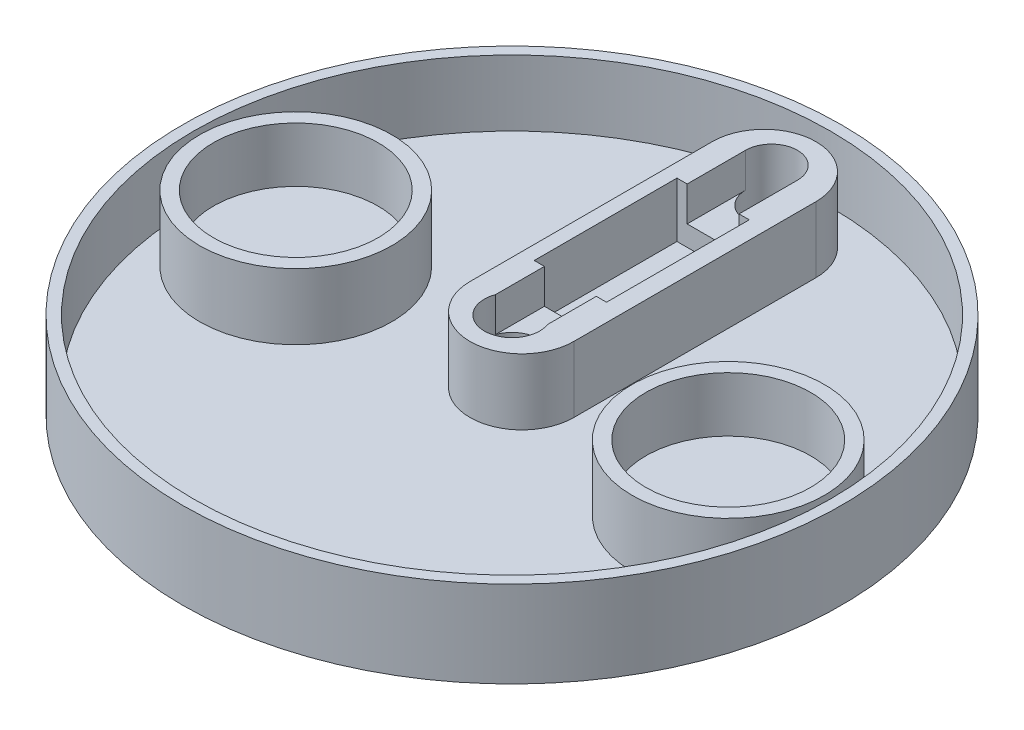
ISO-10303-21;
HEADER;
FILE_DESCRIPTION(('STEP AP214'),'2;1');
FILE_NAME('part.step','',(''),(''),'','','');
FILE_SCHEMA(('AUTOMOTIVE_DESIGN { 1 0 10303 214 1 1 1 1 }'));
ENDSEC;
DATA;
#1=APPLICATION_CONTEXT('core data for automotive mechanical design processes');
#2=APPLICATION_PROTOCOL_DEFINITION('international standard','automotive_design',2000,#1);
#3=PRODUCT_CONTEXT('',#1,'mechanical');
#4=PRODUCT('Part','Part','',(#3));
#5=PRODUCT_RELATED_PRODUCT_CATEGORY('part','',(#4));
#6=PRODUCT_DEFINITION_FORMATION('','',#4);
#7=PRODUCT_DEFINITION_CONTEXT('part definition',#1,'design');
#8=PRODUCT_DEFINITION('design','',#6,#7);
#9=PRODUCT_DEFINITION_SHAPE('','',#8);
#10=(LENGTH_UNIT() NAMED_UNIT(*) SI_UNIT(.MILLI.,.METRE.));
#11=(NAMED_UNIT(*) PLANE_ANGLE_UNIT() SI_UNIT($,.RADIAN.));
#12=(NAMED_UNIT(*) SI_UNIT($,.STERADIAN.) SOLID_ANGLE_UNIT());
#13=UNCERTAINTY_MEASURE_WITH_UNIT(LENGTH_MEASURE(1.E-05),#10,'distance_accuracy_value','');
#14=(GEOMETRIC_REPRESENTATION_CONTEXT(3) GLOBAL_UNCERTAINTY_ASSIGNED_CONTEXT((#13)) GLOBAL_UNIT_ASSIGNED_CONTEXT((#10,
#11,#12)) REPRESENTATION_CONTEXT('',''));
#15=CARTESIAN_POINT('',(0.,0.,0.));
#16=DIRECTION('',(0.,0.,1.));
#17=DIRECTION('',(1.,0.,0.));
#18=AXIS2_PLACEMENT_3D('',#15,#16,#17);
#19=CARTESIAN_POINT('',(0.213535998229149,10.,-28.9330974921723));
#20=DIRECTION('',(0.,1.,0.));
#21=DIRECTION('',(0.,0.,1.));
#22=AXIS2_PLACEMENT_3D('',#19,#20,#21);
#23=CYLINDRICAL_SURFACE('',#22,6.);
#24=DIRECTION('',(0.,1.,0.));
#25=VECTOR('',#24,1.);
#26=CARTESIAN_POINT('',(-5.78646400177085,2.38,-28.9330974921723));
#27=LINE('',#26,#25);
#28=CARTESIAN_POINT('',(-5.78646400177085,10.,-28.9330974921723));
#29=VERTEX_POINT('',#28);
#30=CARTESIAN_POINT('',(-5.78646400177085,2.38,-28.9330974921723));
#31=VERTEX_POINT('',#30);
#32=EDGE_CURVE('E328',#29,#31,#27,.F.);
#33=ORIENTED_EDGE('',*,*,#32,.F.);
#34=CARTESIAN_POINT('',(0.213535998229149,10.,-28.9330974921723));
#35=DIRECTION('',(0.,1.,0.));
#36=DIRECTION('',(0.,0.,1.));
#37=AXIS2_PLACEMENT_3D('',#34,#35,#36);
#38=CIRCLE('',#37,6.);
#39=CARTESIAN_POINT('',(6.21353599822915,10.,-28.9330974921723));
#40=VERTEX_POINT('',#39);
#41=EDGE_CURVE('E49',#40,#29,#38,.T.);
#42=ORIENTED_EDGE('',*,*,#41,.F.);
#43=DIRECTION('',(0.,1.,0.));
#44=VECTOR('',#43,1.);
#45=CARTESIAN_POINT('',(6.21353599822915,2.38,-28.9330974921723));
#46=LINE('',#45,#44);
#47=CARTESIAN_POINT('',(6.21353599822915,2.38,-28.9330974921723));
#48=VERTEX_POINT('',#47);
#49=EDGE_CURVE('E332',#48,#40,#46,.T.);
#50=ORIENTED_EDGE('',*,*,#49,.F.);
#51=CARTESIAN_POINT('',(0.213535998229149,2.38,-28.9330974921723));
#52=DIRECTION('',(0.,1.,0.));
#53=DIRECTION('',(0.,0.,1.));
#54=AXIS2_PLACEMENT_3D('',#51,#52,#53);
#55=CIRCLE('',#54,6.);
#56=EDGE_CURVE('E11',#48,#31,#55,.T.);
#57=ORIENTED_EDGE('',*,*,#56,.T.);
#58=EDGE_LOOP('',(#33,#42,#50,#57));
#59=FACE_BOUND('',#58,.T.);
#60=ADVANCED_FACE('F40',(#59),#23,.T.);
#61=CARTESIAN_POINT('',(0.213535998229152,2.38,-0.933097492172249));
#62=DIRECTION('',(0.,1.,0.));
#63=DIRECTION('',(0.,0.,1.));
#64=AXIS2_PLACEMENT_3D('',#61,#62,#63);
#65=CYLINDRICAL_SURFACE('',#64,6.);
#66=DIRECTION('',(0.,1.,0.));
#67=VECTOR('',#66,1.);
#68=CARTESIAN_POINT('',(-5.78646400177085,2.38,-0.933097492172248));
#69=LINE('',#68,#67);
#70=CARTESIAN_POINT('',(-5.78646400177085,2.38,-0.933097492172248));
#71=VERTEX_POINT('',#70);
#72=CARTESIAN_POINT('',(-5.78646400177085,10.,-0.933097492172248));
#73=VERTEX_POINT('',#72);
#74=EDGE_CURVE('E314',#71,#73,#69,.T.);
#75=ORIENTED_EDGE('',*,*,#74,.F.);
#76=CARTESIAN_POINT('',(0.213535998229152,2.38,-0.933097492172249));
#77=DIRECTION('',(0.,1.,0.));
#78=DIRECTION('',(0.,0.,1.));
#79=AXIS2_PLACEMENT_3D('',#76,#77,#78);
#80=CIRCLE('',#79,6.);
#81=CARTESIAN_POINT('',(6.21353599822915,2.38,-0.933097492172248));
#82=VERTEX_POINT('',#81);
#83=EDGE_CURVE('E325',#71,#82,#80,.T.);
#84=ORIENTED_EDGE('',*,*,#83,.T.);
#85=DIRECTION('',(0.,1.,0.));
#86=VECTOR('',#85,1.);
#87=CARTESIAN_POINT('',(6.21353599822915,2.38,-0.933097492172248));
#88=LINE('',#87,#86);
#89=CARTESIAN_POINT('',(6.21353599822915,10.,-0.933097492172248));
#90=VERTEX_POINT('',#89);
#91=EDGE_CURVE('E318',#90,#82,#88,.F.);
#92=ORIENTED_EDGE('',*,*,#91,.F.);
#93=CARTESIAN_POINT('',(0.213535998229152,10.,-0.933097492172249));
#94=DIRECTION('',(0.,1.,0.));
#95=DIRECTION('',(0.,0.,1.));
#96=AXIS2_PLACEMENT_3D('',#93,#94,#95);
#97=CIRCLE('',#96,6.);
#98=EDGE_CURVE('E322',#73,#90,#97,.T.);
#99=ORIENTED_EDGE('',*,*,#98,.F.);
#100=EDGE_LOOP('',(#75,#84,#92,#99));
#101=FACE_BOUND('',#100,.T.);
#102=ADVANCED_FACE('F446',(#101),#65,.T.);
#103=CARTESIAN_POINT('',(0.,10.,0.));
#104=DIRECTION('',(0.,1.,0.));
#105=DIRECTION('',(0.,0.,1.));
#106=AXIS2_PLACEMENT_3D('',#103,#104,#105);
#107=PLANE('',#106);
#108=DIRECTION('',(0.,0.,-1.));
#109=VECTOR('',#108,1.);
#110=CARTESIAN_POINT('',(3.,10.,-30.));
#111=LINE('',#110,#109);
#112=CARTESIAN_POINT('',(3.,10.,-1.113552872566));
#113=VERTEX_POINT('',#112);
#114=CARTESIAN_POINT('',(3.,10.,-6.74893096043785));
#115=VERTEX_POINT('',#114);
#116=EDGE_CURVE('E387',#113,#115,#111,.T.);
#117=ORIENTED_EDGE('',*,*,#116,.F.);
#118=CARTESIAN_POINT('',(0.,10.,0.));
#119=DIRECTION('',(0.,1.,0.));
#120=DIRECTION('',(0.,0.,1.));
#121=AXIS2_PLACEMENT_3D('',#118,#119,#120);
#122=CIRCLE('',#121,3.2);
#123=CARTESIAN_POINT('',(-3.,10.,-1.11355287256601));
#124=VERTEX_POINT('',#123);
#125=EDGE_CURVE('E209',#124,#113,#122,.T.);
#126=ORIENTED_EDGE('',*,*,#125,.F.);
#127=DIRECTION('',(0.,0.,1.));
#128=VECTOR('',#127,1.);
#129=CARTESIAN_POINT('',(-3.,10.,-30.));
#130=LINE('',#129,#128);
#131=CARTESIAN_POINT('',(-3.,10.,-6.74893096043785));
#132=VERTEX_POINT('',#131);
#133=EDGE_CURVE('E378',#132,#124,#130,.T.);
#134=ORIENTED_EDGE('',*,*,#133,.F.);
#135=DIRECTION('',(1.,0.,0.));
#136=VECTOR('',#135,1.);
#137=CARTESIAN_POINT('',(-4.17911289016784,10.,-6.74893096043785));
#138=LINE('',#137,#136);
#139=CARTESIAN_POINT('',(-4.17911289016784,10.,-6.74893096043785));
#140=VERTEX_POINT('',#139);
#141=EDGE_CURVE('E245',#140,#132,#138,.T.);
#142=ORIENTED_EDGE('',*,*,#141,.F.);
#143=DIRECTION('',(0.,0.,1.));
#144=VECTOR('',#143,1.);
#145=CARTESIAN_POINT('',(-4.17911289016784,10.,-23.2510690395621));
#146=LINE('',#145,#144);
#147=CARTESIAN_POINT('',(-4.17911289016784,10.,-23.2510690395621));
#148=VERTEX_POINT('',#147);
#149=EDGE_CURVE('E265',#148,#140,#146,.T.);
#150=ORIENTED_EDGE('',*,*,#149,.F.);
#151=DIRECTION('',(-1.,0.,0.));
#152=VECTOR('',#151,1.);
#153=CARTESIAN_POINT('',(-4.17911289016784,10.,-23.2510690395621));
#154=LINE('',#153,#152);
#155=CARTESIAN_POINT('',(-3.,10.,-23.2510690395621));
#156=VERTEX_POINT('',#155);
#157=EDGE_CURVE('E260',#156,#148,#154,.T.);
#158=ORIENTED_EDGE('',*,*,#157,.F.);
#159=CARTESIAN_POINT('',(-3.,10.,-30.));
#160=VERTEX_POINT('',#159);
#161=EDGE_CURVE('E383',#160,#156,#130,.T.);
#162=ORIENTED_EDGE('',*,*,#161,.F.);
#163=CARTESIAN_POINT('',(0.,10.,-30.));
#164=DIRECTION('',(0.,1.,0.));
#165=DIRECTION('',(0.,0.,1.));
#166=AXIS2_PLACEMENT_3D('',#163,#164,#165);
#167=CIRCLE('',#166,3.);
#168=CARTESIAN_POINT('',(3.,10.,-30.));
#169=VERTEX_POINT('',#168);
#170=EDGE_CURVE('E178',#169,#160,#167,.T.);
#171=ORIENTED_EDGE('',*,*,#170,.F.);
#172=CARTESIAN_POINT('',(3.,10.,-23.2510690395621));
#173=VERTEX_POINT('',#172);
#174=EDGE_CURVE('E385',#173,#169,#111,.T.);
#175=ORIENTED_EDGE('',*,*,#174,.F.);
#176=CARTESIAN_POINT('',(4.17911289016784,10.,-23.2510690395621));
#177=VERTEX_POINT('',#176);
#178=EDGE_CURVE('E261',#177,#173,#154,.T.);
#179=ORIENTED_EDGE('',*,*,#178,.F.);
#180=DIRECTION('',(0.,0.,-1.));
#181=VECTOR('',#180,1.);
#182=CARTESIAN_POINT('',(4.17911289016784,10.,-23.2510690395621));
#183=LINE('',#182,#181);
#184=CARTESIAN_POINT('',(4.17911289016784,10.,-6.74893096043785));
#185=VERTEX_POINT('',#184);
#186=EDGE_CURVE('E222',#185,#177,#183,.T.);
#187=ORIENTED_EDGE('',*,*,#186,.F.);
#188=EDGE_CURVE('E269',#115,#185,#138,.T.);
#189=ORIENTED_EDGE('',*,*,#188,.F.);
#190=EDGE_LOOP('',(#117,#126,#134,#142,#150,#158,#162,#171,#175,#179,#187,#189));
#191=FACE_BOUND('',#190,.T.);
#192=DIRECTION('',(0.,0.,-1.));
#193=VECTOR('',#192,1.);
#194=CARTESIAN_POINT('',(6.21353599822915,10.,-34.9330974921723));
#195=LINE('',#194,#193);
#196=EDGE_CURVE('E342',#90,#40,#195,.T.);
#197=ORIENTED_EDGE('',*,*,#196,.T.);
#198=ORIENTED_EDGE('',*,*,#41,.T.);
#199=DIRECTION('',(0.,0.,1.));
#200=VECTOR('',#199,1.);
#201=CARTESIAN_POINT('',(-5.78646400177085,10.,-34.9330974921723));
#202=LINE('',#201,#200);
#203=EDGE_CURVE('E339',#29,#73,#202,.T.);
#204=ORIENTED_EDGE('',*,*,#203,.T.);
#205=ORIENTED_EDGE('',*,*,#98,.T.);
#206=EDGE_LOOP('',(#197,#198,#204,#205));
#207=FACE_BOUND('',#206,.T.);
#208=ADVANCED_FACE('F337',(#191,#207),#107,.T.);
#209=CARTESIAN_POINT('',(0.,0.,-30.));
#210=DIRECTION('',(0.,1.,0.));
#211=DIRECTION('',(0.,0.,1.));
#212=AXIS2_PLACEMENT_3D('',#209,#210,#211);
#213=CYLINDRICAL_SURFACE('',#212,3.);
#214=CARTESIAN_POINT('',(0.,0.,-30.));
#215=DIRECTION('',(0.,1.,0.));
#216=DIRECTION('',(0.,0.,1.));
#217=AXIS2_PLACEMENT_3D('',#214,#215,#216);
#218=CIRCLE('',#217,3.);
#219=CARTESIAN_POINT('',(0.,0.,-27.));
#220=VERTEX_POINT('',#219);
#221=EDGE_CURVE('E286',#220,#220,#218,.T.);
#222=ORIENTED_EDGE('',*,*,#221,.F.);
#223=EDGE_LOOP('',(#222));
#224=FACE_BOUND('',#223,.T.);
#225=CARTESIAN_POINT('',(0.,6.,-30.));
#226=DIRECTION('',(0.,1.,0.));
#227=DIRECTION('',(0.,0.,1.));
#228=AXIS2_PLACEMENT_3D('',#225,#226,#227);
#229=CIRCLE('',#228,3.);
#230=CARTESIAN_POINT('',(3.,6.,-30.));
#231=VERTEX_POINT('',#230);
#232=CARTESIAN_POINT('',(-3.,6.,-30.));
#233=VERTEX_POINT('',#232);
#234=EDGE_CURVE('E151',#231,#233,#229,.F.);
#235=ORIENTED_EDGE('',*,*,#234,.F.);
#236=DIRECTION('',(0.,1.,0.));
#237=VECTOR('',#236,1.);
#238=CARTESIAN_POINT('',(3.,6.,-30.));
#239=LINE('',#238,#237);
#240=EDGE_CURVE('E180',#231,#169,#239,.T.);
#241=ORIENTED_EDGE('',*,*,#240,.T.);
#242=ORIENTED_EDGE('',*,*,#170,.T.);
#243=DIRECTION('',(0.,1.,0.));
#244=VECTOR('',#243,1.);
#245=CARTESIAN_POINT('',(-3.,6.,-30.));
#246=LINE('',#245,#244);
#247=EDGE_CURVE('E168',#233,#160,#246,.T.);
#248=ORIENTED_EDGE('',*,*,#247,.F.);
#249=EDGE_LOOP('',(#235,#241,#242,#248));
#250=FACE_BOUND('',#249,.T.);
#251=ADVANCED_FACE('F176',(#224,#250),#213,.F.);
#252=CARTESIAN_POINT('',(0.,0.,0.));
#253=DIRECTION('',(0.,1.,0.));
#254=DIRECTION('',(0.,0.,1.));
#255=AXIS2_PLACEMENT_3D('',#252,#253,#254);
#256=CYLINDRICAL_SURFACE('',#255,2.7);
#257=CARTESIAN_POINT('',(0.,0.,0.));
#258=DIRECTION('',(0.,1.,0.));
#259=DIRECTION('',(0.,0.,1.));
#260=AXIS2_PLACEMENT_3D('',#257,#258,#259);
#261=CIRCLE('',#260,2.7);
#262=CARTESIAN_POINT('',(0.,0.,2.7));
#263=VERTEX_POINT('',#262);
#264=EDGE_CURVE('E218',#263,#263,#261,.T.);
#265=ORIENTED_EDGE('',*,*,#264,.F.);
#266=EDGE_LOOP('',(#265));
#267=FACE_BOUND('',#266,.T.);
#268=CARTESIAN_POINT('',(0.,4.,0.));
#269=DIRECTION('',(0.,1.,0.));
#270=DIRECTION('',(0.,0.,1.));
#271=AXIS2_PLACEMENT_3D('',#268,#269,#270);
#272=CIRCLE('',#271,2.7);
#273=CARTESIAN_POINT('',(0.,4.,2.7));
#274=VERTEX_POINT('',#273);
#275=EDGE_CURVE('E214',#274,#274,#272,.F.);
#276=ORIENTED_EDGE('',*,*,#275,.F.);
#277=EDGE_LOOP('',(#276));
#278=FACE_BOUND('',#277,.T.);
#279=ADVANCED_FACE('F463',(#267,#278),#256,.F.);
#280=CARTESIAN_POINT('',(0.,10.,0.));
#281=DIRECTION('',(0.,-1.,0.));
#282=DIRECTION('',(0.,0.,-1.));
#283=AXIS2_PLACEMENT_3D('',#280,#281,#282);
#284=CYLINDRICAL_SURFACE('',#283,38.1);
#285=CARTESIAN_POINT('',(0.,10.,0.));
#286=DIRECTION('',(0.,1.,0.));
#287=DIRECTION('',(0.,0.,1.));
#288=AXIS2_PLACEMENT_3D('',#285,#286,#287);
#289=CIRCLE('',#288,38.1);
#290=CARTESIAN_POINT('',(0.,10.,38.1));
#291=VERTEX_POINT('',#290);
#292=EDGE_CURVE('E293',#291,#291,#289,.T.);
#293=ORIENTED_EDGE('',*,*,#292,.F.);
#294=EDGE_LOOP('',(#293));
#295=FACE_BOUND('',#294,.T.);
#296=CARTESIAN_POINT('',(0.,0.,0.));
#297=DIRECTION('',(0.,1.,0.));
#298=DIRECTION('',(0.,0.,1.));
#299=AXIS2_PLACEMENT_3D('',#296,#297,#298);
#300=CIRCLE('',#299,38.1);
#301=CARTESIAN_POINT('',(0.,0.,38.1));
#302=VERTEX_POINT('',#301);
#303=EDGE_CURVE('E290',#302,#302,#300,.T.);
#304=ORIENTED_EDGE('',*,*,#303,.T.);
#305=EDGE_LOOP('',(#304));
#306=FACE_BOUND('',#305,.T.);
#307=ADVANCED_FACE('F461',(#295,#306),#284,.T.);
#308=CARTESIAN_POINT('',(0.,10.,0.));
#309=DIRECTION('',(0.,1.,0.));
#310=DIRECTION('',(0.,0.,1.));
#311=AXIS2_PLACEMENT_3D('',#308,#309,#310);
#312=CIRCLE('',#311,36.83);
#313=CARTESIAN_POINT('',(0.,10.,36.83));
#314=VERTEX_POINT('',#313);
#315=EDGE_CURVE('E370',#314,#314,#312,.T.);
#316=ORIENTED_EDGE('',*,*,#315,.F.);
#317=EDGE_LOOP('',(#316));
#318=FACE_BOUND('',#317,.T.);
#319=ORIENTED_EDGE('',*,*,#292,.T.);
#320=EDGE_LOOP('',(#319));
#321=FACE_BOUND('',#320,.T.);
#322=ADVANCED_FACE('F440',(#318,#321),#107,.T.);
#323=CARTESIAN_POINT('',(0.,0.,0.));
#324=DIRECTION('',(0.,1.,0.));
#325=DIRECTION('',(0.,0.,1.));
#326=AXIS2_PLACEMENT_3D('',#323,#324,#325);
#327=PLANE('',#326);
#328=ORIENTED_EDGE('',*,*,#264,.T.);
#329=EDGE_LOOP('',(#328));
#330=FACE_BOUND('',#329,.T.);
#331=ORIENTED_EDGE('',*,*,#221,.T.);
#332=EDGE_LOOP('',(#331));
#333=FACE_BOUND('',#332,.T.);
#334=ORIENTED_EDGE('',*,*,#303,.F.);
#335=EDGE_LOOP('',(#334));
#336=FACE_BOUND('',#335,.T.);
#337=ADVANCED_FACE('F433',(#330,#333,#336),#327,.F.);
#338=CARTESIAN_POINT('',(4.17911289016784,3.65,-23.2510690395621));
#339=DIRECTION('',(1.,0.,0.));
#340=DIRECTION('',(0.,0.,-1.));
#341=AXIS2_PLACEMENT_3D('',#338,#339,#340);
#342=PLANE('',#341);
#343=ORIENTED_EDGE('',*,*,#186,.T.);
#344=DIRECTION('',(0.,1.,0.));
#345=VECTOR('',#344,1.);
#346=CARTESIAN_POINT('',(4.17911289016784,3.65,-23.2510690395621));
#347=LINE('',#346,#345);
#348=CARTESIAN_POINT('',(4.17911289016784,3.65,-23.2510690395621));
#349=VERTEX_POINT('',#348);
#350=EDGE_CURVE('E257',#349,#177,#347,.T.);
#351=ORIENTED_EDGE('',*,*,#350,.F.);
#352=DIRECTION('',(0.,0.,-1.));
#353=VECTOR('',#352,1.);
#354=CARTESIAN_POINT('',(4.17911289016784,3.65,-23.2510690395621));
#355=LINE('',#354,#353);
#356=CARTESIAN_POINT('',(4.17911289016784,3.65,-6.74893096043785));
#357=VERTEX_POINT('',#356);
#358=EDGE_CURVE('E240',#357,#349,#355,.T.);
#359=ORIENTED_EDGE('',*,*,#358,.F.);
#360=DIRECTION('',(0.,1.,0.));
#361=VECTOR('',#360,1.);
#362=CARTESIAN_POINT('',(4.17911289016784,3.65,-6.74893096043785));
#363=LINE('',#362,#361);
#364=EDGE_CURVE('E239',#357,#185,#363,.T.);
#365=ORIENTED_EDGE('',*,*,#364,.T.);
#366=EDGE_LOOP('',(#343,#351,#359,#365));
#367=FACE_BOUND('',#366,.T.);
#368=ADVANCED_FACE('F431',(#367),#342,.F.);
#369=CARTESIAN_POINT('',(-4.17911289016784,3.65,-6.74893096043785));
#370=DIRECTION('',(0.,0.,1.));
#371=DIRECTION('',(1.,0.,0.));
#372=AXIS2_PLACEMENT_3D('',#369,#370,#371);
#373=PLANE('',#372);
#374=DIRECTION('',(-1.,0.,0.));
#375=VECTOR('',#374,1.);
#376=CARTESIAN_POINT('',(-4.17911289016784,6.,-6.74893096043785));
#377=LINE('',#376,#375);
#378=CARTESIAN_POINT('',(3.,6.,-6.74893096043785));
#379=VERTEX_POINT('',#378);
#380=CARTESIAN_POINT('',(-3.,6.,-6.74893096043785));
#381=VERTEX_POINT('',#380);
#382=EDGE_CURVE('E164',#379,#381,#377,.T.);
#383=ORIENTED_EDGE('',*,*,#382,.F.);
#384=DIRECTION('',(0.,1.,0.));
#385=VECTOR('',#384,1.);
#386=CARTESIAN_POINT('',(3.,3.65,-6.74893096043785));
#387=LINE('',#386,#385);
#388=EDGE_CURVE('E205',#379,#115,#387,.T.);
#389=ORIENTED_EDGE('',*,*,#388,.T.);
#390=ORIENTED_EDGE('',*,*,#188,.T.);
#391=ORIENTED_EDGE('',*,*,#364,.F.);
#392=DIRECTION('',(1.,0.,0.));
#393=VECTOR('',#392,1.);
#394=CARTESIAN_POINT('',(-4.17911289016784,3.65,-6.74893096043785));
#395=LINE('',#394,#393);
#396=CARTESIAN_POINT('',(-4.17911289016784,3.65,-6.74893096043785));
#397=VERTEX_POINT('',#396);
#398=EDGE_CURVE('E253',#397,#357,#395,.T.);
#399=ORIENTED_EDGE('',*,*,#398,.F.);
#400=DIRECTION('',(0.,1.,0.));
#401=VECTOR('',#400,1.);
#402=CARTESIAN_POINT('',(-4.17911289016784,3.65,-6.74893096043785));
#403=LINE('',#402,#401);
#404=EDGE_CURVE('E276',#397,#140,#403,.T.);
#405=ORIENTED_EDGE('',*,*,#404,.T.);
#406=ORIENTED_EDGE('',*,*,#141,.T.);
#407=DIRECTION('',(0.,-1.,0.));
#408=VECTOR('',#407,1.);
#409=CARTESIAN_POINT('',(-3.,3.65,-6.74893096043785));
#410=LINE('',#409,#408);
#411=EDGE_CURVE('E197',#132,#381,#410,.T.);
#412=ORIENTED_EDGE('',*,*,#411,.T.);
#413=EDGE_LOOP('',(#383,#389,#390,#391,#399,#405,#406,#412));
#414=FACE_BOUND('',#413,.T.);
#415=ADVANCED_FACE('F425',(#414),#373,.F.);
#416=CARTESIAN_POINT('',(-4.17911289016784,3.65,-23.2510690395621));
#417=DIRECTION('',(-1.,0.,0.));
#418=DIRECTION('',(0.,0.,1.));
#419=AXIS2_PLACEMENT_3D('',#416,#417,#418);
#420=PLANE('',#419);
#421=ORIENTED_EDGE('',*,*,#149,.T.);
#422=ORIENTED_EDGE('',*,*,#404,.F.);
#423=DIRECTION('',(0.,0.,1.));
#424=VECTOR('',#423,1.);
#425=CARTESIAN_POINT('',(-4.17911289016784,3.65,-23.2510690395621));
#426=LINE('',#425,#424);
#427=CARTESIAN_POINT('',(-4.17911289016784,3.65,-23.2510690395621));
#428=VERTEX_POINT('',#427);
#429=EDGE_CURVE('E249',#428,#397,#426,.T.);
#430=ORIENTED_EDGE('',*,*,#429,.F.);
#431=DIRECTION('',(0.,1.,0.));
#432=VECTOR('',#431,1.);
#433=CARTESIAN_POINT('',(-4.17911289016784,3.65,-23.2510690395621));
#434=LINE('',#433,#432);
#435=EDGE_CURVE('E279',#428,#148,#434,.T.);
#436=ORIENTED_EDGE('',*,*,#435,.T.);
#437=EDGE_LOOP('',(#421,#422,#430,#436));
#438=FACE_BOUND('',#437,.T.);
#439=ADVANCED_FACE('F423',(#438),#420,.F.);
#440=CARTESIAN_POINT('',(-4.17911289016784,3.65,-23.2510690395621));
#441=DIRECTION('',(0.,0.,-1.));
#442=DIRECTION('',(-1.,0.,0.));
#443=AXIS2_PLACEMENT_3D('',#440,#441,#442);
#444=PLANE('',#443);
#445=ORIENTED_EDGE('',*,*,#178,.T.);
#446=DIRECTION('',(0.,-1.,0.));
#447=VECTOR('',#446,1.);
#448=CARTESIAN_POINT('',(3.,3.65,-23.2510690395621));
#449=LINE('',#448,#447);
#450=CARTESIAN_POINT('',(3.,6.,-23.2510690395621));
#451=VERTEX_POINT('',#450);
#452=EDGE_CURVE('E201',#173,#451,#449,.T.);
#453=ORIENTED_EDGE('',*,*,#452,.T.);
#454=DIRECTION('',(1.,0.,0.));
#455=VECTOR('',#454,1.);
#456=CARTESIAN_POINT('',(-4.17911289016784,6.,-23.2510690395621));
#457=LINE('',#456,#455);
#458=CARTESIAN_POINT('',(-3.,6.,-23.2510690395621));
#459=VERTEX_POINT('',#458);
#460=EDGE_CURVE('E185',#459,#451,#457,.T.);
#461=ORIENTED_EDGE('',*,*,#460,.F.);
#462=DIRECTION('',(0.,1.,0.));
#463=VECTOR('',#462,1.);
#464=CARTESIAN_POINT('',(-3.,3.65,-23.2510690395621));
#465=LINE('',#464,#463);
#466=EDGE_CURVE('E163',#459,#156,#465,.T.);
#467=ORIENTED_EDGE('',*,*,#466,.T.);
#468=ORIENTED_EDGE('',*,*,#157,.T.);
#469=ORIENTED_EDGE('',*,*,#435,.F.);
#470=DIRECTION('',(-1.,0.,0.));
#471=VECTOR('',#470,1.);
#472=CARTESIAN_POINT('',(-4.17911289016784,3.65,-23.2510690395621));
#473=LINE('',#472,#471);
#474=EDGE_CURVE('E244',#349,#428,#473,.T.);
#475=ORIENTED_EDGE('',*,*,#474,.F.);
#476=ORIENTED_EDGE('',*,*,#350,.T.);
#477=EDGE_LOOP('',(#445,#453,#461,#467,#468,#469,#475,#476));
#478=FACE_BOUND('',#477,.T.);
#479=ADVANCED_FACE('F418',(#478),#444,.F.);
#480=CARTESIAN_POINT('',(0.,3.65,0.));
#481=DIRECTION('',(0.,1.,0.));
#482=DIRECTION('',(0.,0.,1.));
#483=AXIS2_PLACEMENT_3D('',#480,#481,#482);
#484=PLANE('',#483);
#485=ORIENTED_EDGE('',*,*,#358,.T.);
#486=ORIENTED_EDGE('',*,*,#474,.T.);
#487=ORIENTED_EDGE('',*,*,#429,.T.);
#488=ORIENTED_EDGE('',*,*,#398,.T.);
#489=EDGE_LOOP('',(#485,#486,#487,#488));
#490=FACE_BOUND('',#489,.T.);
#491=ADVANCED_FACE('F428',(#490),#484,.T.);
#492=CARTESIAN_POINT('',(0.,4.,0.));
#493=DIRECTION('',(0.,1.,0.));
#494=DIRECTION('',(0.,0.,1.));
#495=AXIS2_PLACEMENT_3D('',#492,#493,#494);
#496=PLANE('',#495);
#497=CARTESIAN_POINT('',(0.,4.,0.));
#498=DIRECTION('',(0.,1.,0.));
#499=DIRECTION('',(0.,0.,1.));
#500=AXIS2_PLACEMENT_3D('',#497,#498,#499);
#501=CIRCLE('',#500,3.2);
#502=CARTESIAN_POINT('',(0.,4.,3.2));
#503=VERTEX_POINT('',#502);
#504=EDGE_CURVE('E210',#503,#503,#501,.T.);
#505=ORIENTED_EDGE('',*,*,#504,.T.);
#506=EDGE_LOOP('',(#505));
#507=FACE_BOUND('',#506,.T.);
#508=ORIENTED_EDGE('',*,*,#275,.T.);
#509=EDGE_LOOP('',(#508));
#510=FACE_BOUND('',#509,.T.);
#511=ADVANCED_FACE('F505',(#507,#510),#496,.T.);
#512=CARTESIAN_POINT('',(0.,4.,0.));
#513=DIRECTION('',(0.,1.,0.));
#514=DIRECTION('',(0.,0.,1.));
#515=AXIS2_PLACEMENT_3D('',#512,#513,#514);
#516=CYLINDRICAL_SURFACE('',#515,3.2);
#517=ORIENTED_EDGE('',*,*,#125,.T.);
#518=DIRECTION('',(0.,1.,0.));
#519=VECTOR('',#518,1.);
#520=CARTESIAN_POINT('',(3.,4.,-1.113552872566));
#521=LINE('',#520,#519);
#522=CARTESIAN_POINT('',(3.,6.,-1.113552872566));
#523=VERTEX_POINT('',#522);
#524=EDGE_CURVE('E310',#113,#523,#521,.F.);
#525=ORIENTED_EDGE('',*,*,#524,.T.);
#526=CARTESIAN_POINT('',(0.,6.,0.));
#527=DIRECTION('',(0.,1.,0.));
#528=DIRECTION('',(0.,0.,1.));
#529=AXIS2_PLACEMENT_3D('',#526,#527,#528);
#530=CIRCLE('',#529,3.2);
#531=CARTESIAN_POINT('',(-3.,6.,-1.11355287256601));
#532=VERTEX_POINT('',#531);
#533=EDGE_CURVE('E297',#532,#523,#530,.F.);
#534=ORIENTED_EDGE('',*,*,#533,.F.);
#535=DIRECTION('',(0.,1.,0.));
#536=VECTOR('',#535,1.);
#537=CARTESIAN_POINT('',(-3.,4.,-1.11355287256601));
#538=LINE('',#537,#536);
#539=EDGE_CURVE('E306',#532,#124,#538,.T.);
#540=ORIENTED_EDGE('',*,*,#539,.T.);
#541=EDGE_LOOP('',(#517,#525,#534,#540));
#542=FACE_BOUND('',#541,.T.);
#543=ORIENTED_EDGE('',*,*,#504,.F.);
#544=EDGE_LOOP('',(#543));
#545=FACE_BOUND('',#544,.T.);
#546=ADVANCED_FACE('F406',(#542,#545),#516,.F.);
#547=CARTESIAN_POINT('',(0.,6.,-30.));
#548=DIRECTION('',(0.,1.,0.));
#549=DIRECTION('',(0.,0.,1.));
#550=AXIS2_PLACEMENT_3D('',#547,#548,#549);
#551=PLANE('',#550);
#552=ORIENTED_EDGE('',*,*,#382,.T.);
#553=DIRECTION('',(0.,0.,1.));
#554=VECTOR('',#553,1.);
#555=CARTESIAN_POINT('',(-3.,6.,-30.));
#556=LINE('',#555,#554);
#557=EDGE_CURVE('E173',#381,#532,#556,.T.);
#558=ORIENTED_EDGE('',*,*,#557,.T.);
#559=ORIENTED_EDGE('',*,*,#533,.T.);
#560=DIRECTION('',(0.,0.,-1.));
#561=VECTOR('',#560,1.);
#562=CARTESIAN_POINT('',(3.,6.,-30.));
#563=LINE('',#562,#561);
#564=EDGE_CURVE('E181',#523,#379,#563,.T.);
#565=ORIENTED_EDGE('',*,*,#564,.T.);
#566=EDGE_LOOP('',(#552,#558,#559,#565));
#567=FACE_BOUND('',#566,.T.);
#568=ADVANCED_FACE('F397',(#567),#551,.T.);
#569=CARTESIAN_POINT('',(-3.,6.,-30.));
#570=DIRECTION('',(-1.,0.,0.));
#571=DIRECTION('',(0.,0.,1.));
#572=AXIS2_PLACEMENT_3D('',#569,#570,#571);
#573=PLANE('',#572);
#574=ORIENTED_EDGE('',*,*,#133,.T.);
#575=ORIENTED_EDGE('',*,*,#539,.F.);
#576=ORIENTED_EDGE('',*,*,#557,.F.);
#577=ORIENTED_EDGE('',*,*,#411,.F.);
#578=EDGE_LOOP('',(#574,#575,#576,#577));
#579=FACE_BOUND('',#578,.T.);
#580=ADVANCED_FACE('F402',(#579),#573,.F.);
#581=CARTESIAN_POINT('',(3.,6.,-30.));
#582=DIRECTION('',(1.,0.,0.));
#583=DIRECTION('',(0.,0.,-1.));
#584=AXIS2_PLACEMENT_3D('',#581,#582,#583);
#585=PLANE('',#584);
#586=ORIENTED_EDGE('',*,*,#564,.F.);
#587=ORIENTED_EDGE('',*,*,#524,.F.);
#588=ORIENTED_EDGE('',*,*,#116,.T.);
#589=ORIENTED_EDGE('',*,*,#388,.F.);
#590=EDGE_LOOP('',(#586,#587,#588,#589));
#591=FACE_BOUND('',#590,.T.);
#592=ADVANCED_FACE('F408',(#591),#585,.F.);
#593=ORIENTED_EDGE('',*,*,#174,.T.);
#594=ORIENTED_EDGE('',*,*,#240,.F.);
#595=EDGE_CURVE('E157',#451,#231,#563,.T.);
#596=ORIENTED_EDGE('',*,*,#595,.F.);
#597=ORIENTED_EDGE('',*,*,#452,.F.);
#598=EDGE_LOOP('',(#593,#594,#596,#597));
#599=FACE_BOUND('',#598,.T.);
#600=ADVANCED_FACE('F548',(#599),#585,.F.);
#601=EDGE_CURVE('E154',#233,#459,#556,.T.);
#602=ORIENTED_EDGE('',*,*,#601,.F.);
#603=ORIENTED_EDGE('',*,*,#247,.T.);
#604=ORIENTED_EDGE('',*,*,#161,.T.);
#605=ORIENTED_EDGE('',*,*,#466,.F.);
#606=EDGE_LOOP('',(#602,#603,#604,#605));
#607=FACE_BOUND('',#606,.T.);
#608=ADVANCED_FACE('F167',(#607),#573,.F.);
#609=ORIENTED_EDGE('',*,*,#234,.T.);
#610=ORIENTED_EDGE('',*,*,#601,.T.);
#611=ORIENTED_EDGE('',*,*,#460,.T.);
#612=ORIENTED_EDGE('',*,*,#595,.T.);
#613=EDGE_LOOP('',(#609,#610,#611,#612));
#614=FACE_BOUND('',#613,.T.);
#615=ADVANCED_FACE('F153',(#614),#551,.T.);
#616=CARTESIAN_POINT('',(0.,2.38,0.));
#617=DIRECTION('',(0.,1.,0.));
#618=DIRECTION('',(0.,0.,1.));
#619=AXIS2_PLACEMENT_3D('',#616,#617,#618);
#620=CYLINDRICAL_SURFACE('',#619,36.83);
#621=CARTESIAN_POINT('',(0.,2.38,0.));
#622=DIRECTION('',(0.,1.,0.));
#623=DIRECTION('',(0.,0.,1.));
#624=AXIS2_PLACEMENT_3D('',#621,#622,#623);
#625=CIRCLE('',#624,36.83);
#626=CARTESIAN_POINT('',(0.,2.38,36.83));
#627=VERTEX_POINT('',#626);
#628=EDGE_CURVE('E374',#627,#627,#625,.T.);
#629=CARTESIAN_POINT('',(0.,2.38,36.83));
#630=CARTESIAN_POINT('',(0.,2.459375,36.83));
#631=CARTESIAN_POINT('',(0.,2.53875,36.83));
#632=CARTESIAN_POINT('',(0.,2.6975,36.83));
#633=CARTESIAN_POINT('',(0.,2.776875,36.83));
#634=CARTESIAN_POINT('',(0.,2.935625,36.83));
#635=CARTESIAN_POINT('',(0.,3.015,36.83));
#636=CARTESIAN_POINT('',(0.,3.17375,36.83));
#637=CARTESIAN_POINT('',(0.,3.253125,36.83));
#638=CARTESIAN_POINT('',(0.,3.411875,36.83));
#639=CARTESIAN_POINT('',(0.,3.49125,36.83));
#640=CARTESIAN_POINT('',(0.,3.65,36.83));
#641=CARTESIAN_POINT('',(0.,3.729375,36.83));
#642=CARTESIAN_POINT('',(0.,3.888125,36.83));
#643=CARTESIAN_POINT('',(0.,3.9675,36.83));
#644=CARTESIAN_POINT('',(0.,4.12625,36.83));
#645=CARTESIAN_POINT('',(0.,4.205625,36.83));
#646=CARTESIAN_POINT('',(0.,4.364375,36.83));
#647=CARTESIAN_POINT('',(0.,4.44375,36.83));
#648=CARTESIAN_POINT('',(0.,4.6025,36.83));
#649=CARTESIAN_POINT('',(0.,4.681875,36.83));
#650=CARTESIAN_POINT('',(0.,4.840625,36.83));
#651=CARTESIAN_POINT('',(0.,4.92,36.83));
#652=CARTESIAN_POINT('',(0.,5.07875,36.83));
#653=CARTESIAN_POINT('',(0.,5.158125,36.83));
#654=CARTESIAN_POINT('',(0.,5.316875,36.83));
#655=CARTESIAN_POINT('',(0.,5.39625,36.83));
#656=CARTESIAN_POINT('',(0.,5.555,36.83));
#657=CARTESIAN_POINT('',(0.,5.634375,36.83));
#658=CARTESIAN_POINT('',(0.,5.793125,36.83));
#659=CARTESIAN_POINT('',(0.,5.8725,36.83));
#660=CARTESIAN_POINT('',(0.,6.03125,36.83));
#661=CARTESIAN_POINT('',(0.,6.110625,36.83));
#662=CARTESIAN_POINT('',(0.,6.269375,36.83));
#663=CARTESIAN_POINT('',(0.,6.34875,36.83));
#664=CARTESIAN_POINT('',(0.,6.5075,36.83));
#665=CARTESIAN_POINT('',(0.,6.586875,36.83));
#666=CARTESIAN_POINT('',(0.,6.745625,36.83));
#667=CARTESIAN_POINT('',(0.,6.825,36.83));
#668=CARTESIAN_POINT('',(0.,6.98375,36.83));
#669=CARTESIAN_POINT('',(0.,7.063125,36.83));
#670=CARTESIAN_POINT('',(0.,7.221875,36.83));
#671=CARTESIAN_POINT('',(0.,7.30125,36.83));
#672=CARTESIAN_POINT('',(0.,7.46,36.83));
#673=CARTESIAN_POINT('',(0.,7.539375,36.83));
#674=CARTESIAN_POINT('',(0.,7.698125,36.83));
#675=CARTESIAN_POINT('',(0.,7.7775,36.83));
#676=CARTESIAN_POINT('',(0.,7.93625,36.83));
#677=CARTESIAN_POINT('',(0.,8.015625,36.83));
#678=CARTESIAN_POINT('',(0.,8.174375,36.83));
#679=CARTESIAN_POINT('',(0.,8.25375,36.83));
#680=CARTESIAN_POINT('',(0.,8.4125,36.83));
#681=CARTESIAN_POINT('',(0.,8.491875,36.83));
#682=CARTESIAN_POINT('',(0.,8.650625,36.83));
#683=CARTESIAN_POINT('',(0.,8.73,36.83));
#684=CARTESIAN_POINT('',(0.,8.88875,36.83));
#685=CARTESIAN_POINT('',(0.,8.968125,36.83));
#686=CARTESIAN_POINT('',(0.,9.126875,36.83));
#687=CARTESIAN_POINT('',(0.,9.20625,36.83));
#688=CARTESIAN_POINT('',(0.,9.365,36.83));
#689=CARTESIAN_POINT('',(0.,9.444375,36.83));
#690=CARTESIAN_POINT('',(0.,9.603125,36.83));
#691=CARTESIAN_POINT('',(0.,9.6825,36.83));
#692=CARTESIAN_POINT('',(0.,9.84125,36.83));
#693=CARTESIAN_POINT('',(0.,9.920625,36.83));
#694=CARTESIAN_POINT('',(0.,10.,36.83));
#695=B_SPLINE_CURVE_WITH_KNOTS('',3,(#629,#630,#631,#632,#633,#634,#635,#636,#637,#638,#639,
#640,#641,#642,#643,#644,#645,#646,#647,#648,#649,#650,#651,#652,#653,#654,#655,#656,#657,#658,
#659,#660,#661,#662,#663,#664,#665,#666,#667,#668,#669,#670,#671,#672,#673,#674,#675,#676,#677,
#678,#679,#680,#681,#682,#683,#684,#685,#686,#687,#688,#689,#690,#691,#692,#693,#694),
.UNSPECIFIED.,.F.,.F.,(4,2,2,2,2,2,2,2,2,2,2,2,2,2,2,2,2,2,2,2,2,2,2,2,2,2,2,2,2,2,2,2,4),(0.,
0.238125,0.47625,0.714375,0.9525,1.190625,1.42875,1.666875,1.905,2.143125,2.38125,2.619375,
2.8575,3.095625,3.33375,3.571875,3.81,4.048125,4.28625,4.524375,4.7625,5.000625,5.23875,
5.476875,5.715,5.953125,6.19125,6.429375,6.6675,6.905625,7.14375,7.381875,7.62),.UNSPECIFIED.);
#696=EDGE_CURVE('BSEAM565',#627,#314,#695,.T.);
#697=ORIENTED_EDGE('',*,*,#628,.F.);
#698=ORIENTED_EDGE('',*,*,#315,.T.);
#699=ORIENTED_EDGE('',*,*,#696,.T.);
#700=ORIENTED_EDGE('',*,*,#696,.F.);
#701=EDGE_LOOP('',(#697,#699,#698,#700));
#702=FACE_BOUND('',#701,.T.);
#703=ADVANCED_FACE('F565',(#702),#620,.F.);
#704=CARTESIAN_POINT('',(0.,2.38,0.));
#705=DIRECTION('',(0.,1.,0.));
#706=DIRECTION('',(0.,0.,1.));
#707=AXIS2_PLACEMENT_3D('',#704,#705,#706);
#708=PLANE('',#707);
#709=ORIENTED_EDGE('',*,*,#83,.F.);
#710=DIRECTION('',(0.,0.,1.));
#711=VECTOR('',#710,1.);
#712=CARTESIAN_POINT('',(-5.78646400177085,2.38,-34.9330974921723));
#713=LINE('',#712,#711);
#714=EDGE_CURVE('E352',#31,#71,#713,.T.);
#715=ORIENTED_EDGE('',*,*,#714,.F.);
#716=ORIENTED_EDGE('',*,*,#56,.F.);
#717=DIRECTION('',(0.,0.,-1.));
#718=VECTOR('',#717,1.);
#719=CARTESIAN_POINT('',(6.21353599822915,2.38,-34.9330974921723));
#720=LINE('',#719,#718);
#721=EDGE_CURVE('E347',#82,#48,#720,.T.);
#722=ORIENTED_EDGE('',*,*,#721,.F.);
#723=EDGE_LOOP('',(#709,#715,#716,#722));
#724=FACE_BOUND('',#723,.T.);
#725=CARTESIAN_POINT('',(25.,2.38,0.));
#726=DIRECTION('',(0.,1.,0.));
#727=DIRECTION('',(0.,0.,1.));
#728=AXIS2_PLACEMENT_3D('',#725,#726,#727);
#729=CIRCLE('',#728,11.1125);
#730=CARTESIAN_POINT('',(25.,2.38,11.1125));
#731=VERTEX_POINT('',#730);
#732=EDGE_CURVE('E357',#731,#731,#729,.T.);
#733=ORIENTED_EDGE('',*,*,#732,.F.);
#734=EDGE_LOOP('',(#733));
#735=FACE_BOUND('',#734,.T.);
#736=CARTESIAN_POINT('',(-25.,2.38,0.));
#737=DIRECTION('',(0.,1.,0.));
#738=DIRECTION('',(0.,0.,1.));
#739=AXIS2_PLACEMENT_3D('',#736,#737,#738);
#740=CIRCLE('',#739,11.1125);
#741=CARTESIAN_POINT('',(-25.,2.38,11.1125));
#742=VERTEX_POINT('',#741);
#743=EDGE_CURVE('E366',#742,#742,#740,.T.);
#744=ORIENTED_EDGE('',*,*,#743,.F.);
#745=EDGE_LOOP('',(#744));
#746=FACE_BOUND('',#745,.T.);
#747=ORIENTED_EDGE('',*,*,#628,.T.);
#748=EDGE_LOOP('',(#747));
#749=FACE_BOUND('',#748,.T.);
#750=ADVANCED_FACE('F572',(#724,#735,#746,#749),#708,.T.);
#751=CARTESIAN_POINT('',(-25.,2.38,0.));
#752=DIRECTION('',(0.,1.,0.));
#753=DIRECTION('',(0.,0.,1.));
#754=AXIS2_PLACEMENT_3D('',#751,#752,#753);
#755=CYLINDRICAL_SURFACE('',#754,11.1125);
#756=CARTESIAN_POINT('',(-25.,10.,0.));
#757=DIRECTION('',(0.,1.,0.));
#758=DIRECTION('',(0.,0.,1.));
#759=AXIS2_PLACEMENT_3D('',#756,#757,#758);
#760=CIRCLE('',#759,11.1125);
#761=CARTESIAN_POINT('',(-25.,10.,11.1125));
#762=VERTEX_POINT('',#761);
#763=EDGE_CURVE('E361',#762,#762,#760,.T.);
#764=CARTESIAN_POINT('',(-25.,2.38,11.1125));
#765=CARTESIAN_POINT('',(-25.,2.459375,11.1125));
#766=CARTESIAN_POINT('',(-25.,2.53875,11.1125));
#767=CARTESIAN_POINT('',(-25.,2.6975,11.1125));
#768=CARTESIAN_POINT('',(-25.,2.776875,11.1125));
#769=CARTESIAN_POINT('',(-25.,2.935625,11.1125));
#770=CARTESIAN_POINT('',(-25.,3.015,11.1125));
#771=CARTESIAN_POINT('',(-25.,3.17375,11.1125));
#772=CARTESIAN_POINT('',(-25.,3.253125,11.1125));
#773=CARTESIAN_POINT('',(-25.,3.411875,11.1125));
#774=CARTESIAN_POINT('',(-25.,3.49125,11.1125));
#775=CARTESIAN_POINT('',(-25.,3.65,11.1125));
#776=CARTESIAN_POINT('',(-25.,3.729375,11.1125));
#777=CARTESIAN_POINT('',(-25.,3.888125,11.1125));
#778=CARTESIAN_POINT('',(-25.,3.9675,11.1125));
#779=CARTESIAN_POINT('',(-25.,4.12625,11.1125));
#780=CARTESIAN_POINT('',(-25.,4.205625,11.1125));
#781=CARTESIAN_POINT('',(-25.,4.364375,11.1125));
#782=CARTESIAN_POINT('',(-25.,4.44375,11.1125));
#783=CARTESIAN_POINT('',(-25.,4.6025,11.1125));
#784=CARTESIAN_POINT('',(-25.,4.681875,11.1125));
#785=CARTESIAN_POINT('',(-25.,4.840625,11.1125));
#786=CARTESIAN_POINT('',(-25.,4.92,11.1125));
#787=CARTESIAN_POINT('',(-25.,5.07875,11.1125));
#788=CARTESIAN_POINT('',(-25.,5.158125,11.1125));
#789=CARTESIAN_POINT('',(-25.,5.316875,11.1125));
#790=CARTESIAN_POINT('',(-25.,5.39625,11.1125));
#791=CARTESIAN_POINT('',(-25.,5.555,11.1125));
#792=CARTESIAN_POINT('',(-25.,5.634375,11.1125));
#793=CARTESIAN_POINT('',(-25.,5.793125,11.1125));
#794=CARTESIAN_POINT('',(-25.,5.8725,11.1125));
#795=CARTESIAN_POINT('',(-25.,6.03125,11.1125));
#796=CARTESIAN_POINT('',(-25.,6.110625,11.1125));
#797=CARTESIAN_POINT('',(-25.,6.269375,11.1125));
#798=CARTESIAN_POINT('',(-25.,6.34875,11.1125));
#799=CARTESIAN_POINT('',(-25.,6.5075,11.1125));
#800=CARTESIAN_POINT('',(-25.,6.586875,11.1125));
#801=CARTESIAN_POINT('',(-25.,6.745625,11.1125));
#802=CARTESIAN_POINT('',(-25.,6.825,11.1125));
#803=CARTESIAN_POINT('',(-25.,6.98375,11.1125));
#804=CARTESIAN_POINT('',(-25.,7.063125,11.1125));
#805=CARTESIAN_POINT('',(-25.,7.221875,11.1125));
#806=CARTESIAN_POINT('',(-25.,7.30125,11.1125));
#807=CARTESIAN_POINT('',(-25.,7.46,11.1125));
#808=CARTESIAN_POINT('',(-25.,7.539375,11.1125));
#809=CARTESIAN_POINT('',(-25.,7.698125,11.1125));
#810=CARTESIAN_POINT('',(-25.,7.7775,11.1125));
#811=CARTESIAN_POINT('',(-25.,7.93625,11.1125));
#812=CARTESIAN_POINT('',(-25.,8.015625,11.1125));
#813=CARTESIAN_POINT('',(-25.,8.174375,11.1125));
#814=CARTESIAN_POINT('',(-25.,8.25375,11.1125));
#815=CARTESIAN_POINT('',(-25.,8.4125,11.1125));
#816=CARTESIAN_POINT('',(-25.,8.491875,11.1125));
#817=CARTESIAN_POINT('',(-25.,8.650625,11.1125));
#818=CARTESIAN_POINT('',(-25.,8.73,11.1125));
#819=CARTESIAN_POINT('',(-25.,8.88875,11.1125));
#820=CARTESIAN_POINT('',(-25.,8.968125,11.1125));
#821=CARTESIAN_POINT('',(-25.,9.126875,11.1125));
#822=CARTESIAN_POINT('',(-25.,9.20625,11.1125));
#823=CARTESIAN_POINT('',(-25.,9.365,11.1125));
#824=CARTESIAN_POINT('',(-25.,9.444375,11.1125));
#825=CARTESIAN_POINT('',(-25.,9.603125,11.1125));
#826=CARTESIAN_POINT('',(-25.,9.6825,11.1125));
#827=CARTESIAN_POINT('',(-25.,9.84125,11.1125));
#828=CARTESIAN_POINT('',(-25.,9.920625,11.1125));
#829=CARTESIAN_POINT('',(-25.,10.,11.1125));
#830=B_SPLINE_CURVE_WITH_KNOTS('',3,(#764,#765,#766,#767,#768,#769,#770,#771,#772,#773,#774,
#775,#776,#777,#778,#779,#780,#781,#782,#783,#784,#785,#786,#787,#788,#789,#790,#791,#792,#793,
#794,#795,#796,#797,#798,#799,#800,#801,#802,#803,#804,#805,#806,#807,#808,#809,#810,#811,#812,
#813,#814,#815,#816,#817,#818,#819,#820,#821,#822,#823,#824,#825,#826,#827,#828,#829),
.UNSPECIFIED.,.F.,.F.,(4,2,2,2,2,2,2,2,2,2,2,2,2,2,2,2,2,2,2,2,2,2,2,2,2,2,2,2,2,2,2,2,4),(0.,
0.238125,0.47625,0.714375,0.9525,1.190625,1.42875,1.666875,1.905,2.143125,2.38125,2.619375,
2.8575,3.095625,3.33375,3.571875,3.81,4.048125,4.28625,4.524375,4.7625,5.000625,5.23875,
5.476875,5.715,5.953125,6.19125,6.429375,6.6675,6.905625,7.14375,7.381875,7.62),.UNSPECIFIED.);
#831=EDGE_CURVE('BSEAM582',#742,#762,#830,.T.);
#832=ORIENTED_EDGE('',*,*,#743,.T.);
#833=ORIENTED_EDGE('',*,*,#763,.F.);
#834=ORIENTED_EDGE('',*,*,#831,.T.);
#835=ORIENTED_EDGE('',*,*,#831,.F.);
#836=EDGE_LOOP('',(#832,#834,#833,#835));
#837=FACE_BOUND('',#836,.T.);
#838=ADVANCED_FACE('F582',(#837),#755,.T.);
#839=CARTESIAN_POINT('',(25.,2.38,0.));
#840=DIRECTION('',(0.,1.,0.));
#841=DIRECTION('',(0.,0.,1.));
#842=AXIS2_PLACEMENT_3D('',#839,#840,#841);
#843=CYLINDRICAL_SURFACE('',#842,11.1125);
#844=CARTESIAN_POINT('',(25.,10.,0.));
#845=DIRECTION('',(0.,1.,0.));
#846=DIRECTION('',(0.,0.,1.));
#847=AXIS2_PLACEMENT_3D('',#844,#845,#846);
#848=CIRCLE('',#847,11.1125);
#849=CARTESIAN_POINT('',(25.,10.,11.1125));
#850=VERTEX_POINT('',#849);
#851=EDGE_CURVE('E362',#850,#850,#848,.T.);
#852=CARTESIAN_POINT('',(25.,2.38,11.1125));
#853=CARTESIAN_POINT('',(25.,2.459375,11.1125));
#854=CARTESIAN_POINT('',(25.,2.53875,11.1125));
#855=CARTESIAN_POINT('',(25.,2.6975,11.1125));
#856=CARTESIAN_POINT('',(25.,2.776875,11.1125));
#857=CARTESIAN_POINT('',(25.,2.935625,11.1125));
#858=CARTESIAN_POINT('',(25.,3.015,11.1125));
#859=CARTESIAN_POINT('',(25.,3.17375,11.1125));
#860=CARTESIAN_POINT('',(25.,3.253125,11.1125));
#861=CARTESIAN_POINT('',(25.,3.411875,11.1125));
#862=CARTESIAN_POINT('',(25.,3.49125,11.1125));
#863=CARTESIAN_POINT('',(25.,3.65,11.1125));
#864=CARTESIAN_POINT('',(25.,3.729375,11.1125));
#865=CARTESIAN_POINT('',(25.,3.888125,11.1125));
#866=CARTESIAN_POINT('',(25.,3.9675,11.1125));
#867=CARTESIAN_POINT('',(25.,4.12625,11.1125));
#868=CARTESIAN_POINT('',(25.,4.205625,11.1125));
#869=CARTESIAN_POINT('',(25.,4.364375,11.1125));
#870=CARTESIAN_POINT('',(25.,4.44375,11.1125));
#871=CARTESIAN_POINT('',(25.,4.6025,11.1125));
#872=CARTESIAN_POINT('',(25.,4.681875,11.1125));
#873=CARTESIAN_POINT('',(25.,4.840625,11.1125));
#874=CARTESIAN_POINT('',(25.,4.92,11.1125));
#875=CARTESIAN_POINT('',(25.,5.07875,11.1125));
#876=CARTESIAN_POINT('',(25.,5.158125,11.1125));
#877=CARTESIAN_POINT('',(25.,5.316875,11.1125));
#878=CARTESIAN_POINT('',(25.,5.39625,11.1125));
#879=CARTESIAN_POINT('',(25.,5.555,11.1125));
#880=CARTESIAN_POINT('',(25.,5.634375,11.1125));
#881=CARTESIAN_POINT('',(25.,5.793125,11.1125));
#882=CARTESIAN_POINT('',(25.,5.8725,11.1125));
#883=CARTESIAN_POINT('',(25.,6.03125,11.1125));
#884=CARTESIAN_POINT('',(25.,6.110625,11.1125));
#885=CARTESIAN_POINT('',(25.,6.269375,11.1125));
#886=CARTESIAN_POINT('',(25.,6.34875,11.1125));
#887=CARTESIAN_POINT('',(25.,6.5075,11.1125));
#888=CARTESIAN_POINT('',(25.,6.586875,11.1125));
#889=CARTESIAN_POINT('',(25.,6.745625,11.1125));
#890=CARTESIAN_POINT('',(25.,6.825,11.1125));
#891=CARTESIAN_POINT('',(25.,6.98375,11.1125));
#892=CARTESIAN_POINT('',(25.,7.063125,11.1125));
#893=CARTESIAN_POINT('',(25.,7.221875,11.1125));
#894=CARTESIAN_POINT('',(25.,7.30125,11.1125));
#895=CARTESIAN_POINT('',(25.,7.46,11.1125));
#896=CARTESIAN_POINT('',(25.,7.539375,11.1125));
#897=CARTESIAN_POINT('',(25.,7.698125,11.1125));
#898=CARTESIAN_POINT('',(25.,7.7775,11.1125));
#899=CARTESIAN_POINT('',(25.,7.93625,11.1125));
#900=CARTESIAN_POINT('',(25.,8.015625,11.1125));
#901=CARTESIAN_POINT('',(25.,8.174375,11.1125));
#902=CARTESIAN_POINT('',(25.,8.25375,11.1125));
#903=CARTESIAN_POINT('',(25.,8.4125,11.1125));
#904=CARTESIAN_POINT('',(25.,8.491875,11.1125));
#905=CARTESIAN_POINT('',(25.,8.650625,11.1125));
#906=CARTESIAN_POINT('',(25.,8.73,11.1125));
#907=CARTESIAN_POINT('',(25.,8.88875,11.1125));
#908=CARTESIAN_POINT('',(25.,8.968125,11.1125));
#909=CARTESIAN_POINT('',(25.,9.126875,11.1125));
#910=CARTESIAN_POINT('',(25.,9.20625,11.1125));
#911=CARTESIAN_POINT('',(25.,9.365,11.1125));
#912=CARTESIAN_POINT('',(25.,9.444375,11.1125));
#913=CARTESIAN_POINT('',(25.,9.603125,11.1125));
#914=CARTESIAN_POINT('',(25.,9.6825,11.1125));
#915=CARTESIAN_POINT('',(25.,9.84125,11.1125));
#916=CARTESIAN_POINT('',(25.,9.920625,11.1125));
#917=CARTESIAN_POINT('',(25.,10.,11.1125));
#918=B_SPLINE_CURVE_WITH_KNOTS('',3,(#852,#853,#854,#855,#856,#857,#858,#859,#860,#861,#862,
#863,#864,#865,#866,#867,#868,#869,#870,#871,#872,#873,#874,#875,#876,#877,#878,#879,#880,#881,
#882,#883,#884,#885,#886,#887,#888,#889,#890,#891,#892,#893,#894,#895,#896,#897,#898,#899,#900,
#901,#902,#903,#904,#905,#906,#907,#908,#909,#910,#911,#912,#913,#914,#915,#916,#917),
.UNSPECIFIED.,.F.,.F.,(4,2,2,2,2,2,2,2,2,2,2,2,2,2,2,2,2,2,2,2,2,2,2,2,2,2,2,2,2,2,2,2,4),(0.,
0.238125,0.47625,0.714375,0.9525,1.190625,1.42875,1.666875,1.905,2.143125,2.38125,2.619375,
2.8575,3.095625,3.33375,3.571875,3.81,4.048125,4.28625,4.524375,4.7625,5.000625,5.23875,
5.476875,5.715,5.953125,6.19125,6.429375,6.6675,6.905625,7.14375,7.381875,7.62),.UNSPECIFIED.);
#919=EDGE_CURVE('BSEAM591',#731,#850,#918,.T.);
#920=ORIENTED_EDGE('',*,*,#732,.T.);
#921=ORIENTED_EDGE('',*,*,#851,.F.);
#922=ORIENTED_EDGE('',*,*,#919,.T.);
#923=ORIENTED_EDGE('',*,*,#919,.F.);
#924=EDGE_LOOP('',(#920,#922,#921,#923));
#925=FACE_BOUND('',#924,.T.);
#926=ADVANCED_FACE('F591',(#925),#843,.T.);
#927=CARTESIAN_POINT('',(6.21353599822915,2.38,-34.9330974921723));
#928=DIRECTION('',(1.,0.,0.));
#929=DIRECTION('',(0.,0.,-1.));
#930=AXIS2_PLACEMENT_3D('',#927,#928,#929);
#931=PLANE('',#930);
#932=ORIENTED_EDGE('',*,*,#721,.T.);
#933=ORIENTED_EDGE('',*,*,#49,.T.);
#934=ORIENTED_EDGE('',*,*,#196,.F.);
#935=ORIENTED_EDGE('',*,*,#91,.T.);
#936=EDGE_LOOP('',(#932,#933,#934,#935));
#937=FACE_BOUND('',#936,.T.);
#938=ADVANCED_FACE('F598',(#937),#931,.T.);
#939=CARTESIAN_POINT('',(-5.78646400177085,2.38,-34.9330974921723));
#940=DIRECTION('',(-1.,0.,0.));
#941=DIRECTION('',(0.,0.,1.));
#942=AXIS2_PLACEMENT_3D('',#939,#940,#941);
#943=PLANE('',#942);
#944=ORIENTED_EDGE('',*,*,#203,.F.);
#945=ORIENTED_EDGE('',*,*,#32,.T.);
#946=ORIENTED_EDGE('',*,*,#714,.T.);
#947=ORIENTED_EDGE('',*,*,#74,.T.);
#948=EDGE_LOOP('',(#944,#945,#946,#947));
#949=FACE_BOUND('',#948,.T.);
#950=ADVANCED_FACE('F344',(#949),#943,.T.);
#951=CARTESIAN_POINT('',(25.,3.65,0.));
#952=DIRECTION('',(0.,1.,0.));
#953=DIRECTION('',(0.,0.,1.));
#954=AXIS2_PLACEMENT_3D('',#951,#952,#953);
#955=PLANE('',#954);
#956=CARTESIAN_POINT('',(25.,3.65,0.));
#957=DIRECTION('',(0.,1.,0.));
#958=DIRECTION('',(0.,0.,1.));
#959=AXIS2_PLACEMENT_3D('',#956,#957,#958);
#960=CIRCLE('',#959,9.525);
#961=CARTESIAN_POINT('',(25.,3.65,9.525));
#962=VERTEX_POINT('',#961);
#963=EDGE_CURVE('E231',#962,#962,#960,.T.);
#964=ORIENTED_EDGE('',*,*,#963,.T.);
#965=EDGE_LOOP('',(#964));
#966=FACE_BOUND('',#965,.T.);
#967=ADVANCED_FACE('F496',(#966),#955,.T.);
#968=CARTESIAN_POINT('',(25.,3.65,0.));
#969=DIRECTION('',(0.,1.,0.));
#970=DIRECTION('',(0.,0.,1.));
#971=AXIS2_PLACEMENT_3D('',#968,#969,#970);
#972=CYLINDRICAL_SURFACE('',#971,9.525);
#973=ORIENTED_EDGE('',*,*,#963,.F.);
#974=EDGE_LOOP('',(#973));
#975=FACE_BOUND('',#974,.T.);
#976=CARTESIAN_POINT('',(25.,10.,0.));
#977=DIRECTION('',(0.,1.,0.));
#978=DIRECTION('',(0.,0.,1.));
#979=AXIS2_PLACEMENT_3D('',#976,#977,#978);
#980=CIRCLE('',#979,9.525);
#981=CARTESIAN_POINT('',(25.,10.,9.525));
#982=VERTEX_POINT('',#981);
#983=EDGE_CURVE('E235',#982,#982,#980,.T.);
#984=ORIENTED_EDGE('',*,*,#983,.T.);
#985=EDGE_LOOP('',(#984));
#986=FACE_BOUND('',#985,.T.);
#987=ADVANCED_FACE('F499',(#975,#986),#972,.F.);
#988=ORIENTED_EDGE('',*,*,#983,.F.);
#989=EDGE_LOOP('',(#988));
#990=FACE_BOUND('',#989,.T.);
#991=ORIENTED_EDGE('',*,*,#851,.T.);
#992=EDGE_LOOP('',(#991));
#993=FACE_BOUND('',#992,.T.);
#994=ADVANCED_FACE('F456',(#990,#993),#107,.T.);
#995=CARTESIAN_POINT('',(-25.,3.65,0.));
#996=DIRECTION('',(0.,1.,0.));
#997=DIRECTION('',(0.,0.,1.));
#998=AXIS2_PLACEMENT_3D('',#995,#996,#997);
#999=PLANE('',#998);
#1000=CARTESIAN_POINT('',(-25.,3.65,0.));
#1001=DIRECTION('',(0.,1.,0.));
#1002=DIRECTION('',(0.,0.,1.));
#1003=AXIS2_PLACEMENT_3D('',#1000,#1001,#1002);
#1004=CIRCLE('',#1003,9.525);
#1005=CARTESIAN_POINT('',(-25.,3.65,9.525));
#1006=VERTEX_POINT('',#1005);
#1007=EDGE_CURVE('E223',#1006,#1006,#1004,.T.);
#1008=ORIENTED_EDGE('',*,*,#1007,.T.);
#1009=EDGE_LOOP('',(#1008));
#1010=FACE_BOUND('',#1009,.T.);
#1011=ADVANCED_FACE('F488',(#1010),#999,.T.);
#1012=CARTESIAN_POINT('',(-25.,3.65,0.));
#1013=DIRECTION('',(0.,1.,0.));
#1014=DIRECTION('',(0.,0.,1.));
#1015=AXIS2_PLACEMENT_3D('',#1012,#1013,#1014);
#1016=CYLINDRICAL_SURFACE('',#1015,9.525);
#1017=ORIENTED_EDGE('',*,*,#1007,.F.);
#1018=EDGE_LOOP('',(#1017));
#1019=FACE_BOUND('',#1018,.T.);
#1020=CARTESIAN_POINT('',(-25.,10.,0.));
#1021=DIRECTION('',(0.,1.,0.));
#1022=DIRECTION('',(0.,0.,1.));
#1023=AXIS2_PLACEMENT_3D('',#1020,#1021,#1022);
#1024=CIRCLE('',#1023,9.525);
#1025=CARTESIAN_POINT('',(-25.,10.,9.525));
#1026=VERTEX_POINT('',#1025);
#1027=EDGE_CURVE('E227',#1026,#1026,#1024,.T.);
#1028=ORIENTED_EDGE('',*,*,#1027,.T.);
#1029=EDGE_LOOP('',(#1028));
#1030=FACE_BOUND('',#1029,.T.);
#1031=ADVANCED_FACE('F491',(#1019,#1030),#1016,.F.);
#1032=ORIENTED_EDGE('',*,*,#1027,.F.);
#1033=EDGE_LOOP('',(#1032));
#1034=FACE_BOUND('',#1033,.T.);
#1035=ORIENTED_EDGE('',*,*,#763,.T.);
#1036=EDGE_LOOP('',(#1035));
#1037=FACE_BOUND('',#1036,.T.);
#1038=ADVANCED_FACE('F467',(#1034,#1037),#107,.T.);
#1039=CLOSED_SHELL('',(#60,#102,#208,#251,#279,#307,#322,#337,#368,#415,#439,#479,#491,#511,
#546,#568,#580,#592,#600,#608,#615,#703,#750,#838,#926,#938,#950,#967,#987,#994,#1011,#1031,#1038));
#1040=MANIFOLD_SOLID_BREP('B2',#1039);
#1041=ADVANCED_BREP_SHAPE_REPRESENTATION('',(#18,#1040),#14);
#1042=SHAPE_DEFINITION_REPRESENTATION(#9,#1041);
ENDSEC;
END-ISO-10303-21;
